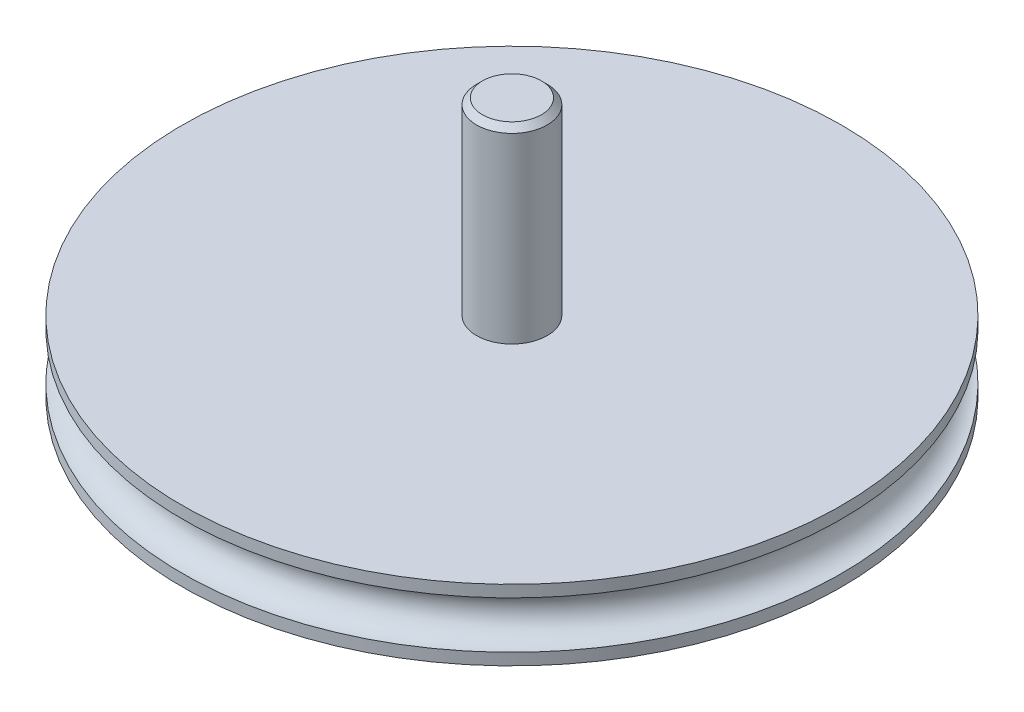
ISO-10303-21;
HEADER;
FILE_DESCRIPTION(('STEP AP214'),'2;1');
FILE_NAME('part.step','',(''),(''),'','','');
FILE_SCHEMA(('AUTOMOTIVE_DESIGN { 1 0 10303 214 1 1 1 1 }'));
ENDSEC;
DATA;
#1=APPLICATION_CONTEXT('core data for automotive mechanical design processes');
#2=APPLICATION_PROTOCOL_DEFINITION('international standard','automotive_design',2000,#1);
#3=PRODUCT_CONTEXT('',#1,'mechanical');
#4=PRODUCT('Part','Part','',(#3));
#5=PRODUCT_RELATED_PRODUCT_CATEGORY('part','',(#4));
#6=PRODUCT_DEFINITION_FORMATION('','',#4);
#7=PRODUCT_DEFINITION_CONTEXT('part definition',#1,'design');
#8=PRODUCT_DEFINITION('design','',#6,#7);
#9=PRODUCT_DEFINITION_SHAPE('','',#8);
#10=(LENGTH_UNIT() NAMED_UNIT(*) SI_UNIT(.MILLI.,.METRE.));
#11=(NAMED_UNIT(*) PLANE_ANGLE_UNIT() SI_UNIT($,.RADIAN.));
#12=(NAMED_UNIT(*) SI_UNIT($,.STERADIAN.) SOLID_ANGLE_UNIT());
#13=UNCERTAINTY_MEASURE_WITH_UNIT(LENGTH_MEASURE(1.E-05),#10,'distance_accuracy_value','');
#14=(GEOMETRIC_REPRESENTATION_CONTEXT(3) GLOBAL_UNCERTAINTY_ASSIGNED_CONTEXT((#13)) GLOBAL_UNIT_ASSIGNED_CONTEXT((#10,
#11,#12)) REPRESENTATION_CONTEXT('',''));
#15=CARTESIAN_POINT('',(0.,0.,0.));
#16=DIRECTION('',(0.,0.,1.));
#17=DIRECTION('',(1.,0.,0.));
#18=AXIS2_PLACEMENT_3D('',#15,#16,#17);
#19=CARTESIAN_POINT('',(0.,16.,0.));
#20=DIRECTION('',(0.,-1.,0.));
#21=DIRECTION('',(0.,0.,-1.));
#22=AXIS2_PLACEMENT_3D('',#19,#20,#21);
#23=CYLINDRICAL_SURFACE('',#22,3.);
#24=CARTESIAN_POINT('',(0.,15.5,0.));
#25=DIRECTION('',(0.,1.,0.));
#26=DIRECTION('',(0.,0.,1.));
#27=AXIS2_PLACEMENT_3D('',#24,#25,#26);
#28=CIRCLE('',#27,3.);
#29=CARTESIAN_POINT('',(0.,15.5,3.));
#30=VERTEX_POINT('',#29);
#31=EDGE_CURVE('E10',#30,#30,#28,.F.);
#32=ORIENTED_EDGE('',*,*,#31,.T.);
#33=EDGE_LOOP('',(#32));
#34=FACE_BOUND('',#33,.T.);
#35=CARTESIAN_POINT('',(0.,0.,0.));
#36=DIRECTION('',(0.,1.,0.));
#37=DIRECTION('',(0.,0.,1.));
#38=AXIS2_PLACEMENT_3D('',#35,#36,#37);
#39=CIRCLE('',#38,3.);
#40=CARTESIAN_POINT('',(0.,0.,3.));
#41=VERTEX_POINT('',#40);
#42=EDGE_CURVE('E53',#41,#41,#39,.T.);
#43=ORIENTED_EDGE('',*,*,#42,.T.);
#44=EDGE_LOOP('',(#43));
#45=FACE_BOUND('',#44,.T.);
#46=ADVANCED_FACE('F41',(#34,#45),#23,.T.);
#47=CARTESIAN_POINT('',(0.,16.,0.));
#48=DIRECTION('',(0.,1.,0.));
#49=DIRECTION('',(0.,0.,1.));
#50=AXIS2_PLACEMENT_3D('',#47,#48,#49);
#51=PLANE('',#50);
#52=CARTESIAN_POINT('',(0.,16.,0.));
#53=DIRECTION('',(0.,1.,0.));
#54=DIRECTION('',(0.,0.,1.));
#55=AXIS2_PLACEMENT_3D('',#52,#53,#54);
#56=CIRCLE('',#55,2.5);
#57=CARTESIAN_POINT('',(0.,16.,2.5));
#58=VERTEX_POINT('',#57);
#59=EDGE_CURVE('E49',#58,#58,#56,.T.);
#60=ORIENTED_EDGE('',*,*,#59,.T.);
#61=EDGE_LOOP('',(#60));
#62=FACE_BOUND('',#61,.T.);
#63=ADVANCED_FACE('F88',(#62),#51,.T.);
#64=CARTESIAN_POINT('',(0.,-5.99999999999999,-28.));
#65=DIRECTION('',(0.,-1.,0.));
#66=DIRECTION('',(0.,0.,-1.));
#67=AXIS2_PLACEMENT_3D('',#64,#65,#66);
#68=PLANE('',#67);
#69=CARTESIAN_POINT('',(0.,-5.99999999999999,0.));
#70=DIRECTION('',(0.,-1.,0.));
#71=DIRECTION('',(0.,0.,-1.));
#72=AXIS2_PLACEMENT_3D('',#69,#70,#71);
#73=CIRCLE('',#72,28.);
#74=CARTESIAN_POINT('',(0.,-5.99999999999998,-28.));
#75=VERTEX_POINT('',#74);
#76=EDGE_CURVE('E57',#75,#75,#73,.T.);
#77=ORIENTED_EDGE('',*,*,#76,.T.);
#78=EDGE_LOOP('',(#77));
#79=FACE_BOUND('',#78,.T.);
#80=ADVANCED_FACE('F92',(#79),#68,.T.);
#81=CARTESIAN_POINT('',(0.,-6.,0.));
#82=DIRECTION('',(0.,-1.,0.));
#83=DIRECTION('',(0.,0.,-1.));
#84=AXIS2_PLACEMENT_3D('',#81,#82,#83);
#85=CYLINDRICAL_SURFACE('',#84,28.);
#86=CARTESIAN_POINT('',(0.,-5.,0.));
#87=DIRECTION('',(0.,-1.,0.));
#88=DIRECTION('',(0.,0.,-1.));
#89=AXIS2_PLACEMENT_3D('',#86,#87,#88);
#90=CIRCLE('',#89,28.);
#91=CARTESIAN_POINT('',(0.,-4.99999999999999,-28.));
#92=VERTEX_POINT('',#91);
#93=EDGE_CURVE('E62',#92,#92,#90,.T.);
#94=ORIENTED_EDGE('',*,*,#93,.T.);
#95=EDGE_LOOP('',(#94));
#96=FACE_BOUND('',#95,.T.);
#97=ORIENTED_EDGE('',*,*,#76,.F.);
#98=EDGE_LOOP('',(#97));
#99=FACE_BOUND('',#98,.T.);
#100=ADVANCED_FACE('F98',(#96,#99),#85,.T.);
#101=CARTESIAN_POINT('',(0.,-3.,0.));
#102=DIRECTION('',(0.,-1.,0.));
#103=DIRECTION('',(0.,0.,-1.));
#104=AXIS2_PLACEMENT_3D('',#101,#102,#103);
#105=TOROIDAL_SURFACE('',#104,28.,2.);
#106=CARTESIAN_POINT('',(0.,-1.,0.));
#107=DIRECTION('',(0.,-1.,0.));
#108=DIRECTION('',(0.,0.,-1.));
#109=AXIS2_PLACEMENT_3D('',#106,#107,#108);
#110=CIRCLE('',#109,28.);
#111=CARTESIAN_POINT('',(0.,-0.999999999999991,-28.));
#112=VERTEX_POINT('',#111);
#113=EDGE_CURVE('E65',#112,#112,#110,.T.);
#114=ORIENTED_EDGE('',*,*,#113,.T.);
#115=EDGE_LOOP('',(#114));
#116=FACE_BOUND('',#115,.T.);
#117=ORIENTED_EDGE('',*,*,#93,.F.);
#118=EDGE_LOOP('',(#117));
#119=FACE_BOUND('',#118,.T.);
#120=ADVANCED_FACE('F85',(#116,#119),#105,.F.);
#121=CARTESIAN_POINT('',(0.,-6.,0.));
#122=DIRECTION('',(0.,-1.,0.));
#123=DIRECTION('',(0.,0.,-1.));
#124=AXIS2_PLACEMENT_3D('',#121,#122,#123);
#125=CYLINDRICAL_SURFACE('',#124,28.);
#126=CARTESIAN_POINT('',(0.,0.,0.));
#127=DIRECTION('',(0.,-1.,0.));
#128=DIRECTION('',(0.,0.,-1.));
#129=AXIS2_PLACEMENT_3D('',#126,#127,#128);
#130=CIRCLE('',#129,28.);
#131=CARTESIAN_POINT('',(0.,0.,-28.));
#132=VERTEX_POINT('',#131);
#133=EDGE_CURVE('E68',#132,#132,#130,.T.);
#134=ORIENTED_EDGE('',*,*,#133,.T.);
#135=EDGE_LOOP('',(#134));
#136=FACE_BOUND('',#135,.T.);
#137=ORIENTED_EDGE('',*,*,#113,.F.);
#138=EDGE_LOOP('',(#137));
#139=FACE_BOUND('',#138,.T.);
#140=ADVANCED_FACE('F72',(#136,#139),#125,.T.);
#141=CARTESIAN_POINT('',(0.,0.,0.));
#142=DIRECTION('',(0.,1.,0.));
#143=DIRECTION('',(0.,0.,1.));
#144=AXIS2_PLACEMENT_3D('',#141,#142,#143);
#145=PLANE('',#144);
#146=ORIENTED_EDGE('',*,*,#42,.F.);
#147=EDGE_LOOP('',(#146));
#148=FACE_BOUND('',#147,.T.);
#149=ORIENTED_EDGE('',*,*,#133,.F.);
#150=EDGE_LOOP('',(#149));
#151=FACE_BOUND('',#150,.T.);
#152=ADVANCED_FACE('F75',(#148,#151),#145,.T.);
#153=CARTESIAN_POINT('',(0.,16.,0.));
#154=DIRECTION('',(0.,-1.,0.));
#155=DIRECTION('',(0.,0.,-1.));
#156=AXIS2_PLACEMENT_3D('',#153,#154,#155);
#157=CONICAL_SURFACE('',#156,2.5,0.785398163397444);
#158=ORIENTED_EDGE('',*,*,#31,.F.);
#159=EDGE_LOOP('',(#158));
#160=FACE_BOUND('',#159,.T.);
#161=ORIENTED_EDGE('',*,*,#59,.F.);
#162=EDGE_LOOP('',(#161));
#163=FACE_BOUND('',#162,.T.);
#164=ADVANCED_FACE('F44',(#160,#163),#157,.T.);
#165=CLOSED_SHELL('',(#46,#63,#80,#100,#120,#140,#152,#164));
#166=MANIFOLD_SOLID_BREP('B2',#165);
#167=ADVANCED_BREP_SHAPE_REPRESENTATION('',(#18,#166),#14);
#168=SHAPE_DEFINITION_REPRESENTATION(#9,#167);
ENDSEC;
END-ISO-10303-21;
